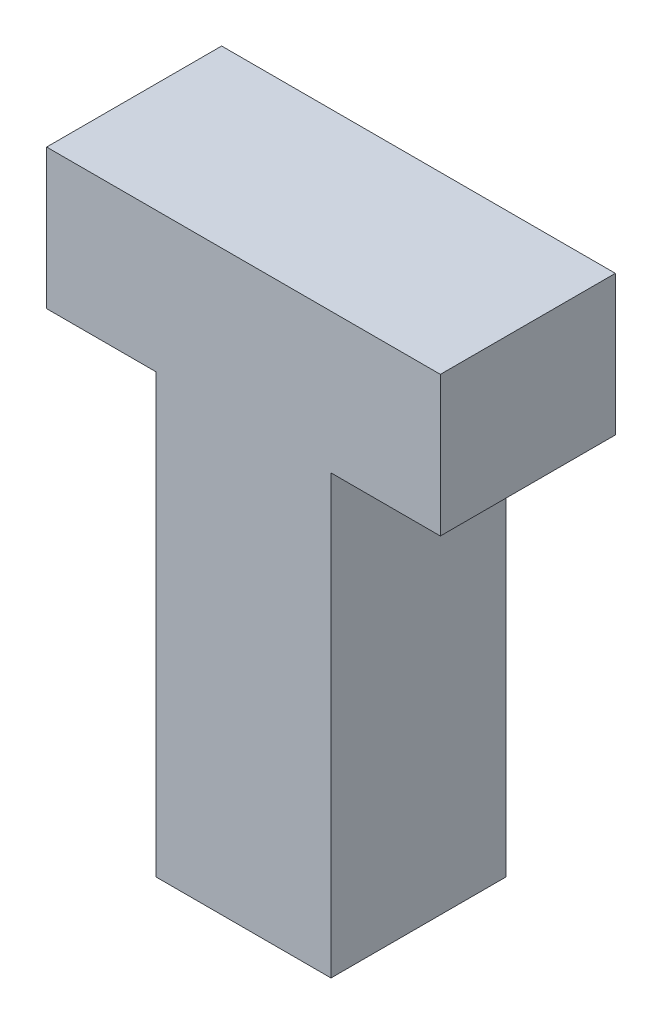
ISO-10303-21;
HEADER;
FILE_DESCRIPTION(('STEP AP214'),'2;1');
FILE_NAME('part.step','',(''),(''),'','','');
FILE_SCHEMA(('AUTOMOTIVE_DESIGN { 1 0 10303 214 1 1 1 1 }'));
ENDSEC;
DATA;
#1=APPLICATION_CONTEXT('core data for automotive mechanical design processes');
#2=APPLICATION_PROTOCOL_DEFINITION('international standard','automotive_design',2000,#1);
#3=PRODUCT_CONTEXT('',#1,'mechanical');
#4=PRODUCT('Part','Part','',(#3));
#5=PRODUCT_RELATED_PRODUCT_CATEGORY('part','',(#4));
#6=PRODUCT_DEFINITION_FORMATION('','',#4);
#7=PRODUCT_DEFINITION_CONTEXT('part definition',#1,'design');
#8=PRODUCT_DEFINITION('design','',#6,#7);
#9=PRODUCT_DEFINITION_SHAPE('','',#8);
#10=(LENGTH_UNIT() NAMED_UNIT(*) SI_UNIT(.MILLI.,.METRE.));
#11=(NAMED_UNIT(*) PLANE_ANGLE_UNIT() SI_UNIT($,.RADIAN.));
#12=(NAMED_UNIT(*) SI_UNIT($,.STERADIAN.) SOLID_ANGLE_UNIT());
#13=UNCERTAINTY_MEASURE_WITH_UNIT(LENGTH_MEASURE(1.E-05),#10,'distance_accuracy_value','');
#14=(GEOMETRIC_REPRESENTATION_CONTEXT(3) GLOBAL_UNCERTAINTY_ASSIGNED_CONTEXT((#13)) GLOBAL_UNIT_ASSIGNED_CONTEXT((#10,
#11,#12)) REPRESENTATION_CONTEXT('',''));
#15=CARTESIAN_POINT('',(0.,0.,0.));
#16=DIRECTION('',(0.,0.,1.));
#17=DIRECTION('',(1.,0.,0.));
#18=AXIS2_PLACEMENT_3D('',#15,#16,#17);
#19=CARTESIAN_POINT('',(-0.999999999999998,0.,1.));
#20=DIRECTION('',(1.,0.,0.));
#21=DIRECTION('',(0.,1.,0.));
#22=AXIS2_PLACEMENT_3D('',#19,#20,#21);
#23=PLANE('',#22);
#24=DIRECTION('',(0.,-1.,0.));
#25=VECTOR('',#24,1.);
#26=CARTESIAN_POINT('',(-0.999999999999998,0.,-1.));
#27=LINE('',#26,#25);
#28=CARTESIAN_POINT('',(-0.999999999999998,5.,-1.));
#29=VERTEX_POINT('',#28);
#30=CARTESIAN_POINT('',(-0.999999999999998,0.,-1.));
#31=VERTEX_POINT('',#30);
#32=EDGE_CURVE('E129',#29,#31,#27,.T.);
#33=ORIENTED_EDGE('',*,*,#32,.T.);
#34=DIRECTION('',(0.,0.,-1.));
#35=VECTOR('',#34,1.);
#36=CARTESIAN_POINT('',(-0.999999999999998,0.,1.));
#37=LINE('',#36,#35);
#38=CARTESIAN_POINT('',(-0.999999999999998,0.,1.));
#39=VERTEX_POINT('',#38);
#40=EDGE_CURVE('E11',#39,#31,#37,.T.);
#41=ORIENTED_EDGE('',*,*,#40,.F.);
#42=DIRECTION('',(0.,-1.,0.));
#43=VECTOR('',#42,1.);
#44=CARTESIAN_POINT('',(-0.999999999999998,0.,1.));
#45=LINE('',#44,#43);
#46=CARTESIAN_POINT('',(-0.999999999999998,5.,1.));
#47=VERTEX_POINT('',#46);
#48=EDGE_CURVE('E144',#47,#39,#45,.T.);
#49=ORIENTED_EDGE('',*,*,#48,.F.);
#50=DIRECTION('',(0.,0.,-1.));
#51=VECTOR('',#50,1.);
#52=CARTESIAN_POINT('',(-0.999999999999998,5.,1.));
#53=LINE('',#52,#51);
#54=EDGE_CURVE('E125',#47,#29,#53,.T.);
#55=ORIENTED_EDGE('',*,*,#54,.T.);
#56=EDGE_LOOP('',(#33,#41,#49,#55));
#57=FACE_BOUND('',#56,.T.);
#58=ADVANCED_FACE('F34',(#57),#23,.F.);
#59=CARTESIAN_POINT('',(0.999999999999998,0.,1.));
#60=DIRECTION('',(0.,1.,0.));
#61=DIRECTION('',(-1.,0.,0.));
#62=AXIS2_PLACEMENT_3D('',#59,#60,#61);
#63=PLANE('',#62);
#64=DIRECTION('',(1.,0.,0.));
#65=VECTOR('',#64,1.);
#66=CARTESIAN_POINT('',(0.999999999999998,0.,-1.));
#67=LINE('',#66,#65);
#68=CARTESIAN_POINT('',(0.999999999999998,0.,-1.));
#69=VERTEX_POINT('',#68);
#70=EDGE_CURVE('E132',#31,#69,#67,.T.);
#71=ORIENTED_EDGE('',*,*,#70,.T.);
#72=DIRECTION('',(0.,0.,-1.));
#73=VECTOR('',#72,1.);
#74=CARTESIAN_POINT('',(0.999999999999998,0.,1.));
#75=LINE('',#74,#73);
#76=CARTESIAN_POINT('',(0.999999999999998,0.,1.));
#77=VERTEX_POINT('',#76);
#78=EDGE_CURVE('E42',#77,#69,#75,.T.);
#79=ORIENTED_EDGE('',*,*,#78,.F.);
#80=DIRECTION('',(1.,0.,0.));
#81=VECTOR('',#80,1.);
#82=CARTESIAN_POINT('',(0.999999999999998,0.,1.));
#83=LINE('',#82,#81);
#84=EDGE_CURVE('E93',#39,#77,#83,.T.);
#85=ORIENTED_EDGE('',*,*,#84,.F.);
#86=ORIENTED_EDGE('',*,*,#40,.T.);
#87=EDGE_LOOP('',(#71,#79,#85,#86));
#88=FACE_BOUND('',#87,.T.);
#89=ADVANCED_FACE('F179',(#88),#63,.F.);
#90=CARTESIAN_POINT('',(0.999999999999998,0.,1.));
#91=DIRECTION('',(-1.,0.,0.));
#92=DIRECTION('',(0.,-1.,0.));
#93=AXIS2_PLACEMENT_3D('',#90,#91,#92);
#94=PLANE('',#93);
#95=DIRECTION('',(0.,1.,0.));
#96=VECTOR('',#95,1.);
#97=CARTESIAN_POINT('',(0.999999999999998,0.,-1.));
#98=LINE('',#97,#96);
#99=CARTESIAN_POINT('',(1.,5.,-1.));
#100=VERTEX_POINT('',#99);
#101=EDGE_CURVE('E134',#69,#100,#98,.T.);
#102=ORIENTED_EDGE('',*,*,#101,.T.);
#103=DIRECTION('',(0.,0.,-1.));
#104=VECTOR('',#103,1.);
#105=CARTESIAN_POINT('',(1.,5.,1.));
#106=LINE('',#105,#104);
#107=CARTESIAN_POINT('',(1.,5.,1.));
#108=VERTEX_POINT('',#107);
#109=EDGE_CURVE('E151',#108,#100,#106,.T.);
#110=ORIENTED_EDGE('',*,*,#109,.F.);
#111=DIRECTION('',(0.,1.,0.));
#112=VECTOR('',#111,1.);
#113=CARTESIAN_POINT('',(0.999999999999998,0.,1.));
#114=LINE('',#113,#112);
#115=EDGE_CURVE('E159',#77,#108,#114,.T.);
#116=ORIENTED_EDGE('',*,*,#115,.F.);
#117=ORIENTED_EDGE('',*,*,#78,.T.);
#118=EDGE_LOOP('',(#102,#110,#116,#117));
#119=FACE_BOUND('',#118,.T.);
#120=ADVANCED_FACE('F157',(#119),#94,.F.);
#121=CARTESIAN_POINT('',(1.,5.,1.));
#122=DIRECTION('',(0.,1.,0.));
#123=DIRECTION('',(-1.,0.,0.));
#124=AXIS2_PLACEMENT_3D('',#121,#122,#123);
#125=PLANE('',#124);
#126=DIRECTION('',(1.,0.,0.));
#127=VECTOR('',#126,1.);
#128=CARTESIAN_POINT('',(1.,5.,-1.));
#129=LINE('',#128,#127);
#130=CARTESIAN_POINT('',(2.25,5.,-1.));
#131=VERTEX_POINT('',#130);
#132=EDGE_CURVE('E136',#100,#131,#129,.T.);
#133=ORIENTED_EDGE('',*,*,#132,.T.);
#134=DIRECTION('',(0.,0.,-1.));
#135=VECTOR('',#134,1.);
#136=CARTESIAN_POINT('',(2.25,5.,1.));
#137=LINE('',#136,#135);
#138=CARTESIAN_POINT('',(2.25,5.,1.));
#139=VERTEX_POINT('',#138);
#140=EDGE_CURVE('E148',#139,#131,#137,.T.);
#141=ORIENTED_EDGE('',*,*,#140,.F.);
#142=DIRECTION('',(1.,0.,0.));
#143=VECTOR('',#142,1.);
#144=CARTESIAN_POINT('',(1.,5.,1.));
#145=LINE('',#144,#143);
#146=EDGE_CURVE('E171',#108,#139,#145,.T.);
#147=ORIENTED_EDGE('',*,*,#146,.F.);
#148=ORIENTED_EDGE('',*,*,#109,.T.);
#149=EDGE_LOOP('',(#133,#141,#147,#148));
#150=FACE_BOUND('',#149,.T.);
#151=ADVANCED_FACE('F167',(#150),#125,.F.);
#152=CARTESIAN_POINT('',(2.25,5.,1.));
#153=DIRECTION('',(-1.,0.,0.));
#154=DIRECTION('',(0.,0.,1.));
#155=AXIS2_PLACEMENT_3D('',#152,#153,#154);
#156=PLANE('',#155);
#157=DIRECTION('',(0.,1.,0.));
#158=VECTOR('',#157,1.);
#159=CARTESIAN_POINT('',(2.25,5.,-1.));
#160=LINE('',#159,#158);
#161=CARTESIAN_POINT('',(2.25,6.6,-1.));
#162=VERTEX_POINT('',#161);
#163=EDGE_CURVE('E138',#131,#162,#160,.T.);
#164=ORIENTED_EDGE('',*,*,#163,.T.);
#165=DIRECTION('',(0.,0.,-1.));
#166=VECTOR('',#165,1.);
#167=CARTESIAN_POINT('',(2.25,6.6,1.));
#168=LINE('',#167,#166);
#169=CARTESIAN_POINT('',(2.25,6.6,1.));
#170=VERTEX_POINT('',#169);
#171=EDGE_CURVE('E120',#170,#162,#168,.T.);
#172=ORIENTED_EDGE('',*,*,#171,.F.);
#173=DIRECTION('',(0.,1.,0.));
#174=VECTOR('',#173,1.);
#175=CARTESIAN_POINT('',(2.25,5.,1.));
#176=LINE('',#175,#174);
#177=EDGE_CURVE('E112',#139,#170,#176,.T.);
#178=ORIENTED_EDGE('',*,*,#177,.F.);
#179=ORIENTED_EDGE('',*,*,#140,.T.);
#180=EDGE_LOOP('',(#164,#172,#178,#179));
#181=FACE_BOUND('',#180,.T.);
#182=ADVANCED_FACE('F170',(#181),#156,.F.);
#183=CARTESIAN_POINT('',(-2.25,6.6,1.));
#184=DIRECTION('',(0.,-1.,0.));
#185=DIRECTION('',(0.,0.,-1.));
#186=AXIS2_PLACEMENT_3D('',#183,#184,#185);
#187=PLANE('',#186);
#188=DIRECTION('',(-1.,0.,0.));
#189=VECTOR('',#188,1.);
#190=CARTESIAN_POINT('',(-2.25,6.6,-1.));
#191=LINE('',#190,#189);
#192=CARTESIAN_POINT('',(-2.25,6.6,-1.));
#193=VERTEX_POINT('',#192);
#194=EDGE_CURVE('E119',#162,#193,#191,.T.);
#195=ORIENTED_EDGE('',*,*,#194,.T.);
#196=DIRECTION('',(0.,0.,-1.));
#197=VECTOR('',#196,1.);
#198=CARTESIAN_POINT('',(-2.25,6.6,1.));
#199=LINE('',#198,#197);
#200=CARTESIAN_POINT('',(-2.25,6.6,1.));
#201=VERTEX_POINT('',#200);
#202=EDGE_CURVE('E117',#201,#193,#199,.T.);
#203=ORIENTED_EDGE('',*,*,#202,.F.);
#204=DIRECTION('',(-1.,0.,0.));
#205=VECTOR('',#204,1.);
#206=CARTESIAN_POINT('',(2.25,6.6,1.));
#207=LINE('',#206,#205);
#208=EDGE_CURVE('E106',#170,#201,#207,.T.);
#209=ORIENTED_EDGE('',*,*,#208,.F.);
#210=ORIENTED_EDGE('',*,*,#171,.T.);
#211=EDGE_LOOP('',(#195,#203,#209,#210));
#212=FACE_BOUND('',#211,.T.);
#213=ADVANCED_FACE('F118',(#212),#187,.F.);
#214=CARTESIAN_POINT('',(-2.25,5.,1.));
#215=DIRECTION('',(1.,0.,0.));
#216=DIRECTION('',(0.,0.,-1.));
#217=AXIS2_PLACEMENT_3D('',#214,#215,#216);
#218=PLANE('',#217);
#219=DIRECTION('',(0.,-1.,0.));
#220=VECTOR('',#219,1.);
#221=CARTESIAN_POINT('',(-2.25,5.,-1.));
#222=LINE('',#221,#220);
#223=CARTESIAN_POINT('',(-2.25,5.,-1.));
#224=VERTEX_POINT('',#223);
#225=EDGE_CURVE('E79',#193,#224,#222,.T.);
#226=ORIENTED_EDGE('',*,*,#225,.T.);
#227=DIRECTION('',(0.,0.,-1.));
#228=VECTOR('',#227,1.);
#229=CARTESIAN_POINT('',(-2.25,5.,1.));
#230=LINE('',#229,#228);
#231=CARTESIAN_POINT('',(-2.25,5.,1.));
#232=VERTEX_POINT('',#231);
#233=EDGE_CURVE('E121',#232,#224,#230,.T.);
#234=ORIENTED_EDGE('',*,*,#233,.F.);
#235=DIRECTION('',(0.,-1.,0.));
#236=VECTOR('',#235,1.);
#237=CARTESIAN_POINT('',(-2.25,5.,1.));
#238=LINE('',#237,#236);
#239=EDGE_CURVE('E110',#201,#232,#238,.T.);
#240=ORIENTED_EDGE('',*,*,#239,.F.);
#241=ORIENTED_EDGE('',*,*,#202,.T.);
#242=EDGE_LOOP('',(#226,#234,#240,#241));
#243=FACE_BOUND('',#242,.T.);
#244=ADVANCED_FACE('F123',(#243),#218,.F.);
#245=CARTESIAN_POINT('',(-0.999999999999998,5.,1.));
#246=DIRECTION('',(0.,1.,0.));
#247=DIRECTION('',(0.,0.,1.));
#248=AXIS2_PLACEMENT_3D('',#245,#246,#247);
#249=PLANE('',#248);
#250=DIRECTION('',(1.,0.,0.));
#251=VECTOR('',#250,1.);
#252=CARTESIAN_POINT('',(-0.999999999999998,5.,-1.));
#253=LINE('',#252,#251);
#254=EDGE_CURVE('E85',#224,#29,#253,.T.);
#255=ORIENTED_EDGE('',*,*,#254,.T.);
#256=ORIENTED_EDGE('',*,*,#54,.F.);
#257=DIRECTION('',(1.,0.,0.));
#258=VECTOR('',#257,1.);
#259=CARTESIAN_POINT('',(-0.999999999999998,5.,1.));
#260=LINE('',#259,#258);
#261=EDGE_CURVE('E50',#232,#47,#260,.T.);
#262=ORIENTED_EDGE('',*,*,#261,.F.);
#263=ORIENTED_EDGE('',*,*,#233,.T.);
#264=EDGE_LOOP('',(#255,#256,#262,#263));
#265=FACE_BOUND('',#264,.T.);
#266=ADVANCED_FACE('F195',(#265),#249,.F.);
#267=CARTESIAN_POINT('',(0.,0.,1.));
#268=DIRECTION('',(0.,0.,1.));
#269=DIRECTION('',(1.,0.,0.));
#270=AXIS2_PLACEMENT_3D('',#267,#268,#269);
#271=PLANE('',#270);
#272=ORIENTED_EDGE('',*,*,#48,.T.);
#273=ORIENTED_EDGE('',*,*,#84,.T.);
#274=ORIENTED_EDGE('',*,*,#115,.T.);
#275=ORIENTED_EDGE('',*,*,#146,.T.);
#276=ORIENTED_EDGE('',*,*,#177,.T.);
#277=ORIENTED_EDGE('',*,*,#208,.T.);
#278=ORIENTED_EDGE('',*,*,#239,.T.);
#279=ORIENTED_EDGE('',*,*,#261,.T.);
#280=EDGE_LOOP('',(#272,#273,#274,#275,#276,#277,#278,#279));
#281=FACE_BOUND('',#280,.T.);
#282=ADVANCED_FACE('F108',(#281),#271,.T.);
#283=CARTESIAN_POINT('',(0.,0.,-1.));
#284=DIRECTION('',(0.,0.,1.));
#285=DIRECTION('',(1.,0.,0.));
#286=AXIS2_PLACEMENT_3D('',#283,#284,#285);
#287=PLANE('',#286);
#288=ORIENTED_EDGE('',*,*,#32,.F.);
#289=ORIENTED_EDGE('',*,*,#254,.F.);
#290=ORIENTED_EDGE('',*,*,#225,.F.);
#291=ORIENTED_EDGE('',*,*,#194,.F.);
#292=ORIENTED_EDGE('',*,*,#163,.F.);
#293=ORIENTED_EDGE('',*,*,#132,.F.);
#294=ORIENTED_EDGE('',*,*,#101,.F.);
#295=ORIENTED_EDGE('',*,*,#70,.F.);
#296=EDGE_LOOP('',(#288,#289,#290,#291,#292,#293,#294,#295));
#297=FACE_BOUND('',#296,.T.);
#298=ADVANCED_FACE('F163',(#297),#287,.F.);
#299=CLOSED_SHELL('',(#58,#89,#120,#151,#182,#213,#244,#266,#282,#298));
#300=MANIFOLD_SOLID_BREP('B2',#299);
#301=ADVANCED_BREP_SHAPE_REPRESENTATION('',(#18,#300),#14);
#302=SHAPE_DEFINITION_REPRESENTATION(#9,#301);
ENDSEC;
END-ISO-10303-21;
